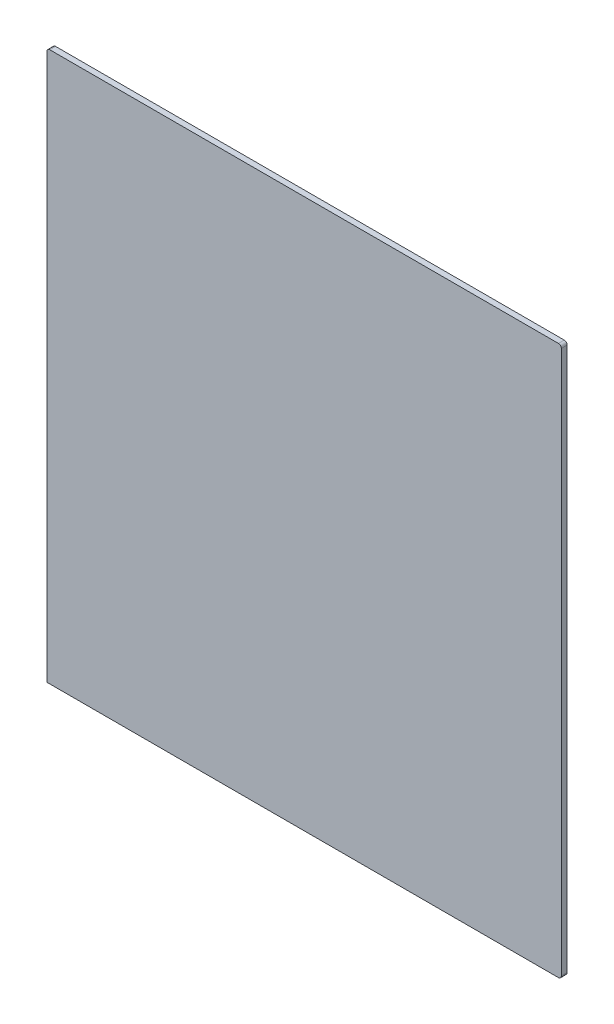
ISO-10303-21;
HEADER;
FILE_DESCRIPTION(('STEP AP214'),'2;1');
FILE_NAME('part.step','',(''),(''),'','','');
FILE_SCHEMA(('AUTOMOTIVE_DESIGN { 1 0 10303 214 1 1 1 1 }'));
ENDSEC;
DATA;
#1=APPLICATION_CONTEXT('core data for automotive mechanical design processes');
#2=APPLICATION_PROTOCOL_DEFINITION('international standard','automotive_design',2000,#1);
#3=PRODUCT_CONTEXT('',#1,'mechanical');
#4=PRODUCT('Part','Part','',(#3));
#5=PRODUCT_RELATED_PRODUCT_CATEGORY('part','',(#4));
#6=PRODUCT_DEFINITION_FORMATION('','',#4);
#7=PRODUCT_DEFINITION_CONTEXT('part definition',#1,'design');
#8=PRODUCT_DEFINITION('design','',#6,#7);
#9=PRODUCT_DEFINITION_SHAPE('','',#8);
#10=(LENGTH_UNIT() NAMED_UNIT(*) SI_UNIT(.MILLI.,.METRE.));
#11=(NAMED_UNIT(*) PLANE_ANGLE_UNIT() SI_UNIT($,.RADIAN.));
#12=(NAMED_UNIT(*) SI_UNIT($,.STERADIAN.) SOLID_ANGLE_UNIT());
#13=UNCERTAINTY_MEASURE_WITH_UNIT(LENGTH_MEASURE(1.E-05),#10,'distance_accuracy_value','');
#14=(GEOMETRIC_REPRESENTATION_CONTEXT(3) GLOBAL_UNCERTAINTY_ASSIGNED_CONTEXT((#13)) GLOBAL_UNIT_ASSIGNED_CONTEXT((#10,
#11,#12)) REPRESENTATION_CONTEXT('',''));
#15=CARTESIAN_POINT('',(0.,0.,0.));
#16=DIRECTION('',(0.,0.,1.));
#17=DIRECTION('',(1.,0.,0.));
#18=AXIS2_PLACEMENT_3D('',#15,#16,#17);
#19=CARTESIAN_POINT('',(-65.6110880871665,322.775681373828,3.));
#20=DIRECTION('',(1.,0.,0.));
#21=DIRECTION('',(0.,0.,-1.));
#22=AXIS2_PLACEMENT_3D('',#19,#20,#21);
#23=PLANE('',#22);
#24=DIRECTION('',(0.,-1.,0.));
#25=VECTOR('',#24,1.);
#26=CARTESIAN_POINT('',(-65.6110880871665,322.775681373828,0.));
#27=LINE('',#26,#25);
#28=CARTESIAN_POINT('',(-65.6110880871665,322.775681373828,0.));
#29=VERTEX_POINT('',#28);
#30=CARTESIAN_POINT('',(-65.6110880871665,40.2756813738279,0.));
#31=VERTEX_POINT('',#30);
#32=EDGE_CURVE('E126',#29,#31,#27,.T.);
#33=ORIENTED_EDGE('',*,*,#32,.T.);
#34=DIRECTION('',(0.,0.,-1.));
#35=VECTOR('',#34,1.);
#36=CARTESIAN_POINT('',(-65.6110880871665,40.2756813738279,3.));
#37=LINE('',#36,#35);
#38=CARTESIAN_POINT('',(-65.6110880871665,40.2756813738279,3.));
#39=VERTEX_POINT('',#38);
#40=EDGE_CURVE('E11',#39,#31,#37,.T.);
#41=ORIENTED_EDGE('',*,*,#40,.F.);
#42=DIRECTION('',(0.,-1.,0.));
#43=VECTOR('',#42,1.);
#44=CARTESIAN_POINT('',(-65.6110880871665,322.775681373828,3.));
#45=LINE('',#44,#43);
#46=CARTESIAN_POINT('',(-65.6110880871665,322.775681373828,3.));
#47=VERTEX_POINT('',#46);
#48=EDGE_CURVE('E138',#47,#39,#45,.T.);
#49=ORIENTED_EDGE('',*,*,#48,.F.);
#50=DIRECTION('',(0.,0.,-1.));
#51=VECTOR('',#50,1.);
#52=CARTESIAN_POINT('',(-65.6110880871665,322.775681373828,3.));
#53=LINE('',#52,#51);
#54=EDGE_CURVE('E122',#47,#29,#53,.T.);
#55=ORIENTED_EDGE('',*,*,#54,.T.);
#56=EDGE_LOOP('',(#33,#41,#49,#55));
#57=FACE_BOUND('',#56,.T.);
#58=ADVANCED_FACE('F36',(#57),#23,.F.);
#59=CARTESIAN_POINT('',(-65.6110880871665,40.2756813738279,3.));
#60=DIRECTION('',(0.,1.,0.));
#61=DIRECTION('',(0.,0.,1.));
#62=AXIS2_PLACEMENT_3D('',#59,#60,#61);
#63=PLANE('',#62);
#64=DIRECTION('',(1.,0.,0.));
#65=VECTOR('',#64,1.);
#66=CARTESIAN_POINT('',(-65.6110880871665,40.2756813738279,0.));
#67=LINE('',#66,#65);
#68=CARTESIAN_POINT('',(198.888911912833,40.2756813738279,0.));
#69=VERTEX_POINT('',#68);
#70=EDGE_CURVE('E129',#31,#69,#67,.T.);
#71=ORIENTED_EDGE('',*,*,#70,.T.);
#72=DIRECTION('',(0.,0.,-1.));
#73=VECTOR('',#72,1.);
#74=CARTESIAN_POINT('',(198.888911912833,40.2756813738279,3.));
#75=LINE('',#74,#73);
#76=CARTESIAN_POINT('',(198.888911912833,40.2756813738279,3.));
#77=VERTEX_POINT('',#76);
#78=EDGE_CURVE('E44',#77,#69,#75,.T.);
#79=ORIENTED_EDGE('',*,*,#78,.F.);
#80=DIRECTION('',(1.,0.,0.));
#81=VECTOR('',#80,1.);
#82=CARTESIAN_POINT('',(-65.6110880871665,40.2756813738279,3.));
#83=LINE('',#82,#81);
#84=EDGE_CURVE('E92',#39,#77,#83,.T.);
#85=ORIENTED_EDGE('',*,*,#84,.F.);
#86=ORIENTED_EDGE('',*,*,#40,.T.);
#87=EDGE_LOOP('',(#71,#79,#85,#86));
#88=FACE_BOUND('',#87,.T.);
#89=ADVANCED_FACE('F163',(#88),#63,.F.);
#90=CARTESIAN_POINT('',(198.888911912833,41.7756813738279,3.));
#91=DIRECTION('',(0.,0.,-1.));
#92=DIRECTION('',(-1.,0.,0.));
#93=AXIS2_PLACEMENT_3D('',#90,#91,#92);
#94=CYLINDRICAL_SURFACE('',#93,1.5);
#95=CARTESIAN_POINT('',(198.888911912833,41.7756813738279,0.));
#96=DIRECTION('',(0.,0.,1.));
#97=DIRECTION('',(-1.,0.,0.));
#98=AXIS2_PLACEMENT_3D('',#95,#96,#97);
#99=CIRCLE('',#98,1.5);
#100=CARTESIAN_POINT('',(200.388911912833,41.7756813738279,0.));
#101=VERTEX_POINT('',#100);
#102=EDGE_CURVE('E131',#69,#101,#99,.T.);
#103=ORIENTED_EDGE('',*,*,#102,.T.);
#104=DIRECTION('',(0.,0.,-1.));
#105=VECTOR('',#104,1.);
#106=CARTESIAN_POINT('',(200.388911912833,41.7756813738279,3.));
#107=LINE('',#106,#105);
#108=CARTESIAN_POINT('',(200.388911912833,41.7756813738279,3.));
#109=VERTEX_POINT('',#108);
#110=EDGE_CURVE('E142',#109,#101,#107,.T.);
#111=ORIENTED_EDGE('',*,*,#110,.F.);
#112=CARTESIAN_POINT('',(198.888911912833,41.7756813738279,3.));
#113=DIRECTION('',(0.,0.,1.));
#114=DIRECTION('',(-1.,0.,0.));
#115=AXIS2_PLACEMENT_3D('',#112,#113,#114);
#116=CIRCLE('',#115,1.5);
#117=EDGE_CURVE('E150',#77,#109,#116,.T.);
#118=ORIENTED_EDGE('',*,*,#117,.F.);
#119=ORIENTED_EDGE('',*,*,#78,.T.);
#120=EDGE_LOOP('',(#103,#111,#118,#119));
#121=FACE_BOUND('',#120,.T.);
#122=ADVANCED_FACE('F148',(#121),#94,.T.);
#123=CARTESIAN_POINT('',(200.388911912833,41.7756813738279,3.));
#124=DIRECTION('',(-1.,0.,0.));
#125=DIRECTION('',(0.,0.,1.));
#126=AXIS2_PLACEMENT_3D('',#123,#124,#125);
#127=PLANE('',#126);
#128=DIRECTION('',(0.,1.,0.));
#129=VECTOR('',#128,1.);
#130=CARTESIAN_POINT('',(200.388911912833,41.7756813738279,0.));
#131=LINE('',#130,#129);
#132=CARTESIAN_POINT('',(200.388911912833,322.775681373828,0.));
#133=VERTEX_POINT('',#132);
#134=EDGE_CURVE('E133',#101,#133,#131,.T.);
#135=ORIENTED_EDGE('',*,*,#134,.T.);
#136=DIRECTION('',(0.,0.,-1.));
#137=VECTOR('',#136,1.);
#138=CARTESIAN_POINT('',(200.388911912833,322.775681373828,3.));
#139=LINE('',#138,#137);
#140=CARTESIAN_POINT('',(200.388911912833,322.775681373828,3.));
#141=VERTEX_POINT('',#140);
#142=EDGE_CURVE('E117',#141,#133,#139,.T.);
#143=ORIENTED_EDGE('',*,*,#142,.F.);
#144=DIRECTION('',(0.,1.,0.));
#145=VECTOR('',#144,1.);
#146=CARTESIAN_POINT('',(200.388911912833,41.7756813738279,3.));
#147=LINE('',#146,#145);
#148=EDGE_CURVE('E108',#109,#141,#147,.T.);
#149=ORIENTED_EDGE('',*,*,#148,.F.);
#150=ORIENTED_EDGE('',*,*,#110,.T.);
#151=EDGE_LOOP('',(#135,#143,#149,#150));
#152=FACE_BOUND('',#151,.T.);
#153=ADVANCED_FACE('F156',(#152),#127,.F.);
#154=CARTESIAN_POINT('',(198.888911912833,322.775681373828,3.));
#155=DIRECTION('',(0.,0.,-1.));
#156=DIRECTION('',(-1.,0.,0.));
#157=AXIS2_PLACEMENT_3D('',#154,#155,#156);
#158=CYLINDRICAL_SURFACE('',#157,1.5);
#159=CARTESIAN_POINT('',(198.888911912833,322.775681373828,0.));
#160=DIRECTION('',(0.,0.,1.));
#161=DIRECTION('',(-1.,0.,0.));
#162=AXIS2_PLACEMENT_3D('',#159,#160,#161);
#163=CIRCLE('',#162,1.5);
#164=CARTESIAN_POINT('',(198.888911912833,324.275681373828,0.));
#165=VERTEX_POINT('',#164);
#166=EDGE_CURVE('E116',#133,#165,#163,.T.);
#167=ORIENTED_EDGE('',*,*,#166,.T.);
#168=DIRECTION('',(0.,0.,-1.));
#169=VECTOR('',#168,1.);
#170=CARTESIAN_POINT('',(198.888911912833,324.275681373828,3.));
#171=LINE('',#170,#169);
#172=CARTESIAN_POINT('',(198.888911912833,324.275681373828,3.));
#173=VERTEX_POINT('',#172);
#174=EDGE_CURVE('E113',#173,#165,#171,.T.);
#175=ORIENTED_EDGE('',*,*,#174,.F.);
#176=CARTESIAN_POINT('',(198.888911912833,322.775681373828,3.));
#177=DIRECTION('',(0.,0.,1.));
#178=DIRECTION('',(-1.,0.,0.));
#179=AXIS2_PLACEMENT_3D('',#176,#177,#178);
#180=CIRCLE('',#179,1.5);
#181=EDGE_CURVE('E102',#141,#173,#180,.T.);
#182=ORIENTED_EDGE('',*,*,#181,.F.);
#183=ORIENTED_EDGE('',*,*,#142,.T.);
#184=EDGE_LOOP('',(#167,#175,#182,#183));
#185=FACE_BOUND('',#184,.T.);
#186=ADVANCED_FACE('F114',(#185),#158,.T.);
#187=CARTESIAN_POINT('',(198.888911912833,324.275681373828,3.));
#188=DIRECTION('',(0.,-1.,0.));
#189=DIRECTION('',(0.,0.,-1.));
#190=AXIS2_PLACEMENT_3D('',#187,#188,#189);
#191=PLANE('',#190);
#192=DIRECTION('',(-1.,0.,0.));
#193=VECTOR('',#192,1.);
#194=CARTESIAN_POINT('',(198.888911912833,324.275681373828,0.));
#195=LINE('',#194,#193);
#196=CARTESIAN_POINT('',(-64.1110880871665,324.275681373828,0.));
#197=VERTEX_POINT('',#196);
#198=EDGE_CURVE('E78',#165,#197,#195,.T.);
#199=ORIENTED_EDGE('',*,*,#198,.T.);
#200=DIRECTION('',(0.,0.,-1.));
#201=VECTOR('',#200,1.);
#202=CARTESIAN_POINT('',(-64.1110880871665,324.275681373828,3.));
#203=LINE('',#202,#201);
#204=CARTESIAN_POINT('',(-64.1110880871665,324.275681373828,3.));
#205=VERTEX_POINT('',#204);
#206=EDGE_CURVE('E118',#205,#197,#203,.T.);
#207=ORIENTED_EDGE('',*,*,#206,.F.);
#208=DIRECTION('',(-1.,0.,0.));
#209=VECTOR('',#208,1.);
#210=CARTESIAN_POINT('',(198.888911912833,324.275681373828,3.));
#211=LINE('',#210,#209);
#212=EDGE_CURVE('E106',#173,#205,#211,.T.);
#213=ORIENTED_EDGE('',*,*,#212,.F.);
#214=ORIENTED_EDGE('',*,*,#174,.T.);
#215=EDGE_LOOP('',(#199,#207,#213,#214));
#216=FACE_BOUND('',#215,.T.);
#217=ADVANCED_FACE('F120',(#216),#191,.F.);
#218=CARTESIAN_POINT('',(-64.1110880871665,322.775681373828,3.));
#219=DIRECTION('',(0.,0.,-1.));
#220=DIRECTION('',(-1.,0.,0.));
#221=AXIS2_PLACEMENT_3D('',#218,#219,#220);
#222=CYLINDRICAL_SURFACE('',#221,1.5);
#223=CARTESIAN_POINT('',(-64.1110880871665,322.775681373828,0.));
#224=DIRECTION('',(0.,0.,1.));
#225=DIRECTION('',(1.,0.,0.));
#226=AXIS2_PLACEMENT_3D('',#223,#224,#225);
#227=CIRCLE('',#226,1.5);
#228=EDGE_CURVE('E84',#197,#29,#227,.T.);
#229=ORIENTED_EDGE('',*,*,#228,.T.);
#230=ORIENTED_EDGE('',*,*,#54,.F.);
#231=CARTESIAN_POINT('',(-64.1110880871665,322.775681373828,3.));
#232=DIRECTION('',(0.,0.,1.));
#233=DIRECTION('',(1.,0.,0.));
#234=AXIS2_PLACEMENT_3D('',#231,#232,#233);
#235=CIRCLE('',#234,1.5);
#236=EDGE_CURVE('E52',#205,#47,#235,.T.);
#237=ORIENTED_EDGE('',*,*,#236,.F.);
#238=ORIENTED_EDGE('',*,*,#206,.T.);
#239=EDGE_LOOP('',(#229,#230,#237,#238));
#240=FACE_BOUND('',#239,.T.);
#241=ADVANCED_FACE('F177',(#240),#222,.T.);
#242=CARTESIAN_POINT('',(198.888911912833,41.7756813738279,3.));
#243=DIRECTION('',(0.,0.,-1.));
#244=DIRECTION('',(-1.,0.,0.));
#245=AXIS2_PLACEMENT_3D('',#242,#243,#244);
#246=PLANE('',#245);
#247=ORIENTED_EDGE('',*,*,#48,.T.);
#248=ORIENTED_EDGE('',*,*,#84,.T.);
#249=ORIENTED_EDGE('',*,*,#117,.T.);
#250=ORIENTED_EDGE('',*,*,#148,.T.);
#251=ORIENTED_EDGE('',*,*,#181,.T.);
#252=ORIENTED_EDGE('',*,*,#212,.T.);
#253=ORIENTED_EDGE('',*,*,#236,.T.);
#254=EDGE_LOOP('',(#247,#248,#249,#250,#251,#252,#253));
#255=FACE_BOUND('',#254,.T.);
#256=ADVANCED_FACE('F104',(#255),#246,.F.);
#257=CARTESIAN_POINT('',(198.888911912833,41.7756813738279,0.));
#258=DIRECTION('',(0.,0.,-1.));
#259=DIRECTION('',(-1.,0.,0.));
#260=AXIS2_PLACEMENT_3D('',#257,#258,#259);
#261=PLANE('',#260);
#262=ORIENTED_EDGE('',*,*,#32,.F.);
#263=ORIENTED_EDGE('',*,*,#228,.F.);
#264=ORIENTED_EDGE('',*,*,#198,.F.);
#265=ORIENTED_EDGE('',*,*,#166,.F.);
#266=ORIENTED_EDGE('',*,*,#134,.F.);
#267=ORIENTED_EDGE('',*,*,#102,.F.);
#268=ORIENTED_EDGE('',*,*,#70,.F.);
#269=EDGE_LOOP('',(#262,#263,#264,#265,#266,#267,#268));
#270=FACE_BOUND('',#269,.T.);
#271=ADVANCED_FACE('F154',(#270),#261,.T.);
#272=CLOSED_SHELL('',(#58,#89,#122,#153,#186,#217,#241,#256,#271));
#273=MANIFOLD_SOLID_BREP('B2',#272);
#274=ADVANCED_BREP_SHAPE_REPRESENTATION('',(#18,#273),#14);
#275=SHAPE_DEFINITION_REPRESENTATION(#9,#274);
ENDSEC;
END-ISO-10303-21;
